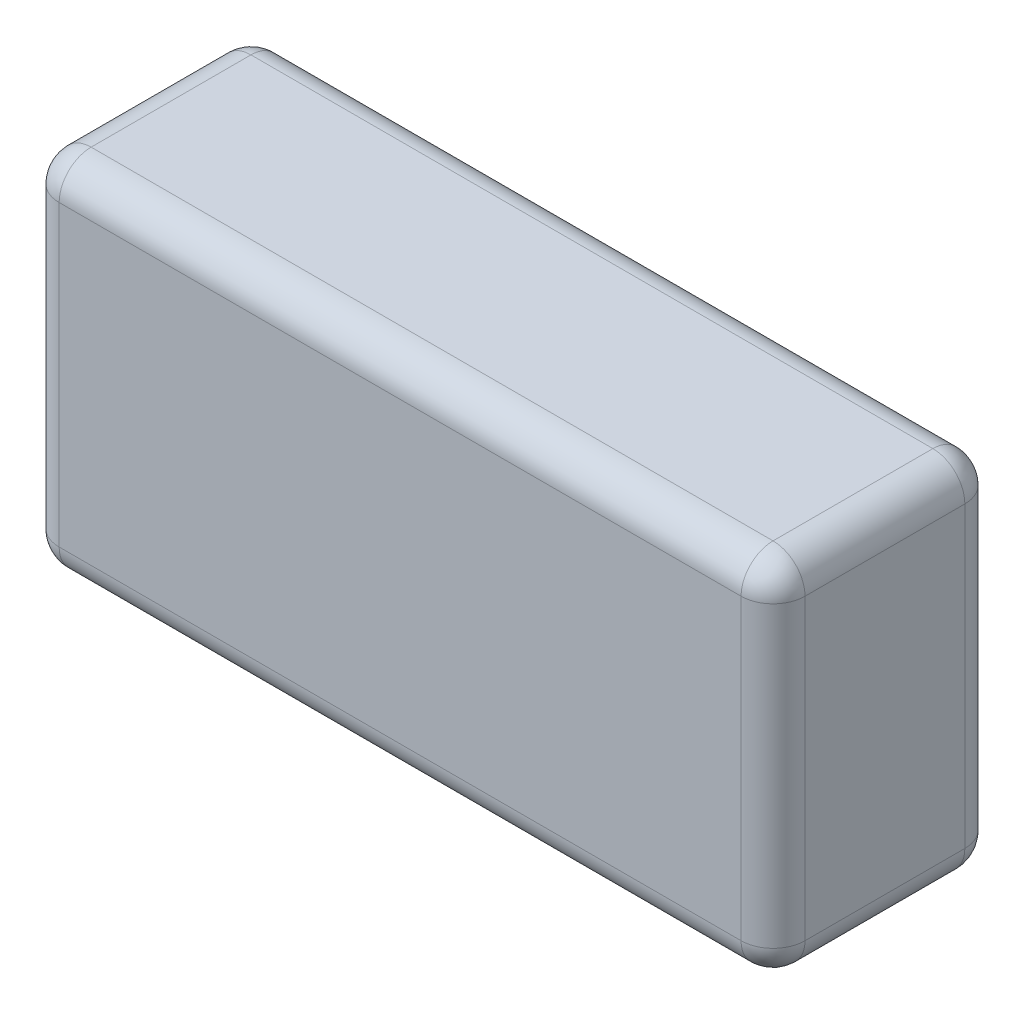
ISO-10303-21;
HEADER;
FILE_DESCRIPTION(('STEP AP214'),'2;1');
FILE_NAME('part.step','',(''),(''),'','','');
FILE_SCHEMA(('AUTOMOTIVE_DESIGN { 1 0 10303 214 1 1 1 1 }'));
ENDSEC;
DATA;
#1=APPLICATION_CONTEXT('core data for automotive mechanical design processes');
#2=APPLICATION_PROTOCOL_DEFINITION('international standard','automotive_design',2000,#1);
#3=PRODUCT_CONTEXT('',#1,'mechanical');
#4=PRODUCT('Part','Part','',(#3));
#5=PRODUCT_RELATED_PRODUCT_CATEGORY('part','',(#4));
#6=PRODUCT_DEFINITION_FORMATION('','',#4);
#7=PRODUCT_DEFINITION_CONTEXT('part definition',#1,'design');
#8=PRODUCT_DEFINITION('design','',#6,#7);
#9=PRODUCT_DEFINITION_SHAPE('','',#8);
#10=(LENGTH_UNIT() NAMED_UNIT(*) SI_UNIT(.MILLI.,.METRE.));
#11=(NAMED_UNIT(*) PLANE_ANGLE_UNIT() SI_UNIT($,.RADIAN.));
#12=(NAMED_UNIT(*) SI_UNIT($,.STERADIAN.) SOLID_ANGLE_UNIT());
#13=UNCERTAINTY_MEASURE_WITH_UNIT(LENGTH_MEASURE(1.E-05),#10,'distance_accuracy_value','');
#14=(GEOMETRIC_REPRESENTATION_CONTEXT(3) GLOBAL_UNCERTAINTY_ASSIGNED_CONTEXT((#13)) GLOBAL_UNIT_ASSIGNED_CONTEXT((#10,
#11,#12)) REPRESENTATION_CONTEXT('',''));
#15=CARTESIAN_POINT('',(0.,0.,0.));
#16=DIRECTION('',(0.,0.,1.));
#17=DIRECTION('',(1.,0.,0.));
#18=AXIS2_PLACEMENT_3D('',#15,#16,#17);
#19=CARTESIAN_POINT('',(-35.,17.,10.5));
#20=DIRECTION('',(1.,0.,0.));
#21=DIRECTION('',(0.,0.,-1.));
#22=AXIS2_PLACEMENT_3D('',#19,#20,#21);
#23=PLANE('',#22);
#24=DIRECTION('',(0.,-1.,0.));
#25=VECTOR('',#24,1.);
#26=CARTESIAN_POINT('',(-35.,17.,-7.5));
#27=LINE('',#26,#25);
#28=CARTESIAN_POINT('',(-35.,14.,-7.5));
#29=VERTEX_POINT('',#28);
#30=CARTESIAN_POINT('',(-35.,-14.,-7.5));
#31=VERTEX_POINT('',#30);
#32=EDGE_CURVE('E131',#29,#31,#27,.T.);
#33=ORIENTED_EDGE('',*,*,#32,.T.);
#34=DIRECTION('',(0.,0.,1.));
#35=VECTOR('',#34,1.);
#36=CARTESIAN_POINT('',(-35.,-14.,10.5));
#37=LINE('',#36,#35);
#38=CARTESIAN_POINT('',(-35.,-14.,7.50000000000004));
#39=VERTEX_POINT('',#38);
#40=EDGE_CURVE('E127',#31,#39,#37,.T.);
#41=ORIENTED_EDGE('',*,*,#40,.T.);
#42=DIRECTION('',(0.,-1.,0.));
#43=VECTOR('',#42,1.);
#44=CARTESIAN_POINT('',(-35.,17.,7.50000000000004));
#45=LINE('',#44,#43);
#46=CARTESIAN_POINT('',(-35.,14.,7.50000000000004));
#47=VERTEX_POINT('',#46);
#48=EDGE_CURVE('E122',#39,#47,#45,.F.);
#49=ORIENTED_EDGE('',*,*,#48,.T.);
#50=DIRECTION('',(0.,0.,1.));
#51=VECTOR('',#50,1.);
#52=CARTESIAN_POINT('',(-35.,14.,-10.5));
#53=LINE('',#52,#51);
#54=EDGE_CURVE('E124',#47,#29,#53,.F.);
#55=ORIENTED_EDGE('',*,*,#54,.T.);
#56=EDGE_LOOP('',(#33,#41,#49,#55));
#57=FACE_BOUND('',#56,.T.);
#58=ADVANCED_FACE('F34',(#57),#23,.F.);
#59=CARTESIAN_POINT('',(35.0000000000002,17.,10.5));
#60=DIRECTION('',(0.,0.,-1.));
#61=DIRECTION('',(-1.,0.,0.));
#62=AXIS2_PLACEMENT_3D('',#59,#60,#61);
#63=PLANE('',#62);
#64=DIRECTION('',(0.,-1.,0.));
#65=VECTOR('',#64,1.);
#66=CARTESIAN_POINT('',(-32.,17.,10.5));
#67=LINE('',#66,#65);
#68=CARTESIAN_POINT('',(-32.,14.,10.5));
#69=VERTEX_POINT('',#68);
#70=CARTESIAN_POINT('',(-32.,-14.,10.5));
#71=VERTEX_POINT('',#70);
#72=EDGE_CURVE('E153',#69,#71,#67,.T.);
#73=ORIENTED_EDGE('',*,*,#72,.T.);
#74=DIRECTION('',(1.,0.,0.));
#75=VECTOR('',#74,1.);
#76=CARTESIAN_POINT('',(35.0000000000002,-14.,10.5));
#77=LINE('',#76,#75);
#78=CARTESIAN_POINT('',(32.0000000000002,-14.,10.5));
#79=VERTEX_POINT('',#78);
#80=EDGE_CURVE('E231',#71,#79,#77,.T.);
#81=ORIENTED_EDGE('',*,*,#80,.T.);
#82=DIRECTION('',(0.,-1.,0.));
#83=VECTOR('',#82,1.);
#84=CARTESIAN_POINT('',(32.0000000000002,17.,10.5));
#85=LINE('',#84,#83);
#86=CARTESIAN_POINT('',(32.0000000000002,14.,10.5));
#87=VERTEX_POINT('',#86);
#88=EDGE_CURVE('E224',#79,#87,#85,.F.);
#89=ORIENTED_EDGE('',*,*,#88,.T.);
#90=DIRECTION('',(1.,0.,0.));
#91=VECTOR('',#90,1.);
#92=CARTESIAN_POINT('',(-35.,14.,10.5));
#93=LINE('',#92,#91);
#94=EDGE_CURVE('E222',#87,#69,#93,.F.);
#95=ORIENTED_EDGE('',*,*,#94,.T.);
#96=EDGE_LOOP('',(#73,#81,#89,#95));
#97=FACE_BOUND('',#96,.T.);
#98=ADVANCED_FACE('F321',(#97),#63,.F.);
#99=CARTESIAN_POINT('',(35.0000000000002,17.,10.5));
#100=DIRECTION('',(-1.,0.,0.));
#101=DIRECTION('',(0.,0.,1.));
#102=AXIS2_PLACEMENT_3D('',#99,#100,#101);
#103=PLANE('',#102);
#104=DIRECTION('',(0.,0.,-1.));
#105=VECTOR('',#104,1.);
#106=CARTESIAN_POINT('',(35.0000000000002,-14.,10.5));
#107=LINE('',#106,#105);
#108=CARTESIAN_POINT('',(35.0000000000002,-14.,7.50000000000004));
#109=VERTEX_POINT('',#108);
#110=CARTESIAN_POINT('',(35.0000000000002,-14.,-7.5));
#111=VERTEX_POINT('',#110);
#112=EDGE_CURVE('E218',#109,#111,#107,.T.);
#113=ORIENTED_EDGE('',*,*,#112,.T.);
#114=DIRECTION('',(0.,-1.,0.));
#115=VECTOR('',#114,1.);
#116=CARTESIAN_POINT('',(35.0000000000002,17.,-7.5));
#117=LINE('',#116,#115);
#118=CARTESIAN_POINT('',(35.0000000000002,14.,-7.5));
#119=VERTEX_POINT('',#118);
#120=EDGE_CURVE('E215',#111,#119,#117,.F.);
#121=ORIENTED_EDGE('',*,*,#120,.T.);
#122=DIRECTION('',(0.,0.,-1.));
#123=VECTOR('',#122,1.);
#124=CARTESIAN_POINT('',(35.0000000000002,14.,10.5));
#125=LINE('',#124,#123);
#126=CARTESIAN_POINT('',(35.0000000000002,14.,7.50000000000004));
#127=VERTEX_POINT('',#126);
#128=EDGE_CURVE('E208',#119,#127,#125,.F.);
#129=ORIENTED_EDGE('',*,*,#128,.T.);
#130=DIRECTION('',(0.,-1.,0.));
#131=VECTOR('',#130,1.);
#132=CARTESIAN_POINT('',(35.0000000000002,17.,7.50000000000004));
#133=LINE('',#132,#131);
#134=EDGE_CURVE('E211',#127,#109,#133,.T.);
#135=ORIENTED_EDGE('',*,*,#134,.T.);
#136=EDGE_LOOP('',(#113,#121,#129,#135));
#137=FACE_BOUND('',#136,.T.);
#138=ADVANCED_FACE('F216',(#137),#103,.F.);
#139=CARTESIAN_POINT('',(35.0000000000002,17.,-10.5));
#140=DIRECTION('',(0.,0.,1.));
#141=DIRECTION('',(1.,0.,0.));
#142=AXIS2_PLACEMENT_3D('',#139,#140,#141);
#143=PLANE('',#142);
#144=DIRECTION('',(-1.,0.,0.));
#145=VECTOR('',#144,1.);
#146=CARTESIAN_POINT('',(35.0000000000002,-14.,-10.5));
#147=LINE('',#146,#145);
#148=CARTESIAN_POINT('',(32.0000000000002,-14.,-10.5));
#149=VERTEX_POINT('',#148);
#150=CARTESIAN_POINT('',(-32.,-14.,-10.5));
#151=VERTEX_POINT('',#150);
#152=EDGE_CURVE('E280',#149,#151,#147,.T.);
#153=ORIENTED_EDGE('',*,*,#152,.T.);
#154=DIRECTION('',(0.,-1.,0.));
#155=VECTOR('',#154,1.);
#156=CARTESIAN_POINT('',(-32.,17.,-10.5));
#157=LINE('',#156,#155);
#158=CARTESIAN_POINT('',(-32.,14.,-10.5));
#159=VERTEX_POINT('',#158);
#160=EDGE_CURVE('E212',#151,#159,#157,.F.);
#161=ORIENTED_EDGE('',*,*,#160,.T.);
#162=DIRECTION('',(-1.,0.,0.));
#163=VECTOR('',#162,1.);
#164=CARTESIAN_POINT('',(35.0000000000002,14.,-10.5));
#165=LINE('',#164,#163);
#166=CARTESIAN_POINT('',(32.0000000000002,14.,-10.5));
#167=VERTEX_POINT('',#166);
#168=EDGE_CURVE('E273',#159,#167,#165,.F.);
#169=ORIENTED_EDGE('',*,*,#168,.T.);
#170=DIRECTION('',(0.,-1.,0.));
#171=VECTOR('',#170,1.);
#172=CARTESIAN_POINT('',(32.0000000000002,17.,-10.5));
#173=LINE('',#172,#171);
#174=EDGE_CURVE('E275',#167,#149,#173,.T.);
#175=ORIENTED_EDGE('',*,*,#174,.T.);
#176=EDGE_LOOP('',(#153,#161,#169,#175));
#177=FACE_BOUND('',#176,.T.);
#178=ADVANCED_FACE('F305',(#177),#143,.F.);
#179=CARTESIAN_POINT('',(0.,17.,0.));
#180=DIRECTION('',(0.,1.,0.));
#181=DIRECTION('',(0.,0.,1.));
#182=AXIS2_PLACEMENT_3D('',#179,#180,#181);
#183=PLANE('',#182);
#184=DIRECTION('',(0.,0.,-1.));
#185=VECTOR('',#184,1.);
#186=CARTESIAN_POINT('',(32.0000000000002,17.,-10.5));
#187=LINE('',#186,#185);
#188=CARTESIAN_POINT('',(32.0000000000002,17.,7.50000000000004));
#189=VERTEX_POINT('',#188);
#190=CARTESIAN_POINT('',(32.0000000000002,17.,-7.5));
#191=VERTEX_POINT('',#190);
#192=EDGE_CURVE('E43',#189,#191,#187,.T.);
#193=ORIENTED_EDGE('',*,*,#192,.T.);
#194=DIRECTION('',(-1.,0.,0.));
#195=VECTOR('',#194,1.);
#196=CARTESIAN_POINT('',(-35.,17.,-7.5));
#197=LINE('',#196,#195);
#198=CARTESIAN_POINT('',(-32.,17.,-7.5));
#199=VERTEX_POINT('',#198);
#200=EDGE_CURVE('E11',#191,#199,#197,.T.);
#201=ORIENTED_EDGE('',*,*,#200,.T.);
#202=DIRECTION('',(0.,0.,1.));
#203=VECTOR('',#202,1.);
#204=CARTESIAN_POINT('',(-32.,17.,10.5));
#205=LINE('',#204,#203);
#206=CARTESIAN_POINT('',(-32.,17.,7.50000000000004));
#207=VERTEX_POINT('',#206);
#208=EDGE_CURVE('E233',#199,#207,#205,.T.);
#209=ORIENTED_EDGE('',*,*,#208,.T.);
#210=DIRECTION('',(1.,0.,0.));
#211=VECTOR('',#210,1.);
#212=CARTESIAN_POINT('',(35.0000000000002,17.,7.50000000000004));
#213=LINE('',#212,#211);
#214=EDGE_CURVE('E54',#207,#189,#213,.T.);
#215=ORIENTED_EDGE('',*,*,#214,.T.);
#216=EDGE_LOOP('',(#193,#201,#209,#215));
#217=FACE_BOUND('',#216,.T.);
#218=ADVANCED_FACE('F484',(#217),#183,.T.);
#219=CARTESIAN_POINT('',(0.,-17.,0.));
#220=DIRECTION('',(0.,1.,0.));
#221=DIRECTION('',(0.,0.,1.));
#222=AXIS2_PLACEMENT_3D('',#219,#220,#221);
#223=PLANE('',#222);
#224=DIRECTION('',(1.,0.,0.));
#225=VECTOR('',#224,1.);
#226=CARTESIAN_POINT('',(0.,-17.,7.50000000000004));
#227=LINE('',#226,#225);
#228=CARTESIAN_POINT('',(32.0000000000002,-17.,7.50000000000004));
#229=VERTEX_POINT('',#228);
#230=CARTESIAN_POINT('',(-32.,-17.,7.50000000000004));
#231=VERTEX_POINT('',#230);
#232=EDGE_CURVE('E269',#229,#231,#227,.F.);
#233=ORIENTED_EDGE('',*,*,#232,.T.);
#234=DIRECTION('',(0.,0.,1.));
#235=VECTOR('',#234,1.);
#236=CARTESIAN_POINT('',(-32.,-17.,0.));
#237=LINE('',#236,#235);
#238=CARTESIAN_POINT('',(-32.,-17.,-7.5));
#239=VERTEX_POINT('',#238);
#240=EDGE_CURVE('E263',#231,#239,#237,.F.);
#241=ORIENTED_EDGE('',*,*,#240,.T.);
#242=DIRECTION('',(-1.,0.,0.));
#243=VECTOR('',#242,1.);
#244=CARTESIAN_POINT('',(0.,-17.,-7.5));
#245=LINE('',#244,#243);
#246=CARTESIAN_POINT('',(32.0000000000002,-17.,-7.5));
#247=VERTEX_POINT('',#246);
#248=EDGE_CURVE('E257',#239,#247,#245,.F.);
#249=ORIENTED_EDGE('',*,*,#248,.T.);
#250=DIRECTION('',(0.,0.,-1.));
#251=VECTOR('',#250,1.);
#252=CARTESIAN_POINT('',(32.0000000000002,-17.,0.));
#253=LINE('',#252,#251);
#254=EDGE_CURVE('E264',#247,#229,#253,.F.);
#255=ORIENTED_EDGE('',*,*,#254,.T.);
#256=EDGE_LOOP('',(#233,#241,#249,#255));
#257=FACE_BOUND('',#256,.T.);
#258=ADVANCED_FACE('F267',(#257),#223,.F.);
#259=CARTESIAN_POINT('',(32.0000000000002,14.,0.));
#260=DIRECTION('',(0.,0.,1.));
#261=DIRECTION('',(1.,0.,0.));
#262=AXIS2_PLACEMENT_3D('',#259,#260,#261);
#263=CYLINDRICAL_SURFACE('',#262,3.);
#264=CARTESIAN_POINT('',(32.0000000000002,14.,-7.5));
#265=DIRECTION('',(0.,0.,-1.));
#266=DIRECTION('',(-1.,0.,0.));
#267=AXIS2_PLACEMENT_3D('',#264,#265,#266);
#268=CIRCLE('',#267,3.);
#269=EDGE_CURVE('E38',#191,#119,#268,.T.);
#270=ORIENTED_EDGE('',*,*,#269,.F.);
#271=ORIENTED_EDGE('',*,*,#192,.F.);
#272=CARTESIAN_POINT('',(32.0000000000002,14.,7.50000000000004));
#273=DIRECTION('',(0.,0.,1.));
#274=DIRECTION('',(1.,0.,0.));
#275=AXIS2_PLACEMENT_3D('',#272,#273,#274);
#276=CIRCLE('',#275,3.);
#277=EDGE_CURVE('E193',#127,#189,#276,.T.);
#278=ORIENTED_EDGE('',*,*,#277,.F.);
#279=ORIENTED_EDGE('',*,*,#128,.F.);
#280=EDGE_LOOP('',(#270,#271,#278,#279));
#281=FACE_BOUND('',#280,.T.);
#282=ADVANCED_FACE('F36',(#281),#263,.T.);
#283=CARTESIAN_POINT('',(32.0000000000002,14.,-7.5));
#284=DIRECTION('',(0.,0.,1.));
#285=DIRECTION('',(1.,0.,0.));
#286=AXIS2_PLACEMENT_3D('',#283,#284,#285);
#287=SPHERICAL_SURFACE('',#286,3.);
#288=CARTESIAN_POINT('',(32.0000000000002,14.,-7.5));
#289=DIRECTION('',(1.,0.,0.));
#290=DIRECTION('',(0.,0.,-1.));
#291=AXIS2_PLACEMENT_3D('',#288,#289,#290);
#292=CIRCLE('',#291,3.);
#293=EDGE_CURVE('E189',#191,#167,#292,.F.);
#294=ORIENTED_EDGE('',*,*,#293,.F.);
#295=ORIENTED_EDGE('',*,*,#269,.T.);
#296=CARTESIAN_POINT('',(32.0000000000002,14.,-7.5));
#297=DIRECTION('',(0.,1.,0.));
#298=DIRECTION('',(0.,0.,1.));
#299=AXIS2_PLACEMENT_3D('',#296,#297,#298);
#300=CIRCLE('',#299,3.);
#301=EDGE_CURVE('E192',#167,#119,#300,.F.);
#302=ORIENTED_EDGE('',*,*,#301,.F.);
#303=EDGE_LOOP('',(#294,#295,#302));
#304=FACE_BOUND('',#303,.T.);
#305=ADVANCED_FACE('F204',(#304),#287,.T.);
#306=CARTESIAN_POINT('',(32.0000000000002,14.,7.50000000000004));
#307=DIRECTION('',(0.,0.,1.));
#308=DIRECTION('',(1.,0.,0.));
#309=AXIS2_PLACEMENT_3D('',#306,#307,#308);
#310=SPHERICAL_SURFACE('',#309,3.);
#311=CARTESIAN_POINT('',(32.0000000000002,14.,7.50000000000004));
#312=DIRECTION('',(0.,1.,0.));
#313=DIRECTION('',(0.,0.,1.));
#314=AXIS2_PLACEMENT_3D('',#311,#312,#313);
#315=CIRCLE('',#314,3.);
#316=EDGE_CURVE('E183',#127,#87,#315,.F.);
#317=ORIENTED_EDGE('',*,*,#316,.F.);
#318=ORIENTED_EDGE('',*,*,#277,.T.);
#319=CARTESIAN_POINT('',(32.0000000000002,14.,7.50000000000004));
#320=DIRECTION('',(1.,0.,0.));
#321=DIRECTION('',(0.,0.,-1.));
#322=AXIS2_PLACEMENT_3D('',#319,#320,#321);
#323=CIRCLE('',#322,3.);
#324=EDGE_CURVE('E186',#87,#189,#323,.F.);
#325=ORIENTED_EDGE('',*,*,#324,.F.);
#326=EDGE_LOOP('',(#317,#318,#325));
#327=FACE_BOUND('',#326,.T.);
#328=ADVANCED_FACE('F457',(#327),#310,.T.);
#329=CARTESIAN_POINT('',(32.0000000000002,17.,-7.5));
#330=DIRECTION('',(0.,-1.,0.));
#331=DIRECTION('',(0.,0.,-1.));
#332=AXIS2_PLACEMENT_3D('',#329,#330,#331);
#333=CYLINDRICAL_SURFACE('',#332,3.);
#334=ORIENTED_EDGE('',*,*,#301,.T.);
#335=ORIENTED_EDGE('',*,*,#120,.F.);
#336=CARTESIAN_POINT('',(32.0000000000002,-14.,-7.5));
#337=DIRECTION('',(0.,-1.,0.));
#338=DIRECTION('',(0.,0.,-1.));
#339=AXIS2_PLACEMENT_3D('',#336,#337,#338);
#340=CIRCLE('',#339,3.);
#341=EDGE_CURVE('E177',#149,#111,#340,.T.);
#342=ORIENTED_EDGE('',*,*,#341,.F.);
#343=ORIENTED_EDGE('',*,*,#174,.F.);
#344=EDGE_LOOP('',(#334,#335,#342,#343));
#345=FACE_BOUND('',#344,.T.);
#346=ADVANCED_FACE('F307',(#345),#333,.T.);
#347=CARTESIAN_POINT('',(0.,14.,-7.5));
#348=DIRECTION('',(1.,0.,0.));
#349=DIRECTION('',(0.,0.,-1.));
#350=AXIS2_PLACEMENT_3D('',#347,#348,#349);
#351=CYLINDRICAL_SURFACE('',#350,3.);
#352=ORIENTED_EDGE('',*,*,#293,.T.);
#353=ORIENTED_EDGE('',*,*,#168,.F.);
#354=CARTESIAN_POINT('',(-32.,14.,-7.5));
#355=DIRECTION('',(-1.,0.,0.));
#356=DIRECTION('',(0.,0.,1.));
#357=AXIS2_PLACEMENT_3D('',#354,#355,#356);
#358=CIRCLE('',#357,3.);
#359=EDGE_CURVE('E174',#199,#159,#358,.T.);
#360=ORIENTED_EDGE('',*,*,#359,.F.);
#361=ORIENTED_EDGE('',*,*,#200,.F.);
#362=EDGE_LOOP('',(#352,#353,#360,#361));
#363=FACE_BOUND('',#362,.T.);
#364=ADVANCED_FACE('F441',(#363),#351,.T.);
#365=CARTESIAN_POINT('',(-32.,14.,0.));
#366=DIRECTION('',(0.,0.,-1.));
#367=DIRECTION('',(-1.,0.,0.));
#368=AXIS2_PLACEMENT_3D('',#365,#366,#367);
#369=CYLINDRICAL_SURFACE('',#368,3.);
#370=CARTESIAN_POINT('',(-32.,14.,7.50000000000004));
#371=DIRECTION('',(0.,0.,1.));
#372=DIRECTION('',(1.,0.,0.));
#373=AXIS2_PLACEMENT_3D('',#370,#371,#372);
#374=CIRCLE('',#373,3.);
#375=EDGE_CURVE('E138',#207,#47,#374,.T.);
#376=ORIENTED_EDGE('',*,*,#375,.F.);
#377=ORIENTED_EDGE('',*,*,#208,.F.);
#378=CARTESIAN_POINT('',(-32.,14.,-7.5));
#379=DIRECTION('',(0.,0.,-1.));
#380=DIRECTION('',(0.,1.,0.));
#381=AXIS2_PLACEMENT_3D('',#378,#379,#380);
#382=CIRCLE('',#381,3.);
#383=EDGE_CURVE('E140',#29,#199,#382,.T.);
#384=ORIENTED_EDGE('',*,*,#383,.F.);
#385=ORIENTED_EDGE('',*,*,#54,.F.);
#386=EDGE_LOOP('',(#376,#377,#384,#385));
#387=FACE_BOUND('',#386,.T.);
#388=ADVANCED_FACE('F136',(#387),#369,.T.);
#389=CARTESIAN_POINT('',(0.,14.,7.50000000000004));
#390=DIRECTION('',(-1.,0.,0.));
#391=DIRECTION('',(0.,0.,1.));
#392=AXIS2_PLACEMENT_3D('',#389,#390,#391);
#393=CYLINDRICAL_SURFACE('',#392,3.);
#394=ORIENTED_EDGE('',*,*,#324,.T.);
#395=ORIENTED_EDGE('',*,*,#214,.F.);
#396=CARTESIAN_POINT('',(-32.,14.,7.50000000000004));
#397=DIRECTION('',(-1.,0.,0.));
#398=DIRECTION('',(0.,-1.,0.));
#399=AXIS2_PLACEMENT_3D('',#396,#397,#398);
#400=CIRCLE('',#399,3.);
#401=EDGE_CURVE('E149',#69,#207,#400,.T.);
#402=ORIENTED_EDGE('',*,*,#401,.F.);
#403=ORIENTED_EDGE('',*,*,#94,.F.);
#404=EDGE_LOOP('',(#394,#395,#402,#403));
#405=FACE_BOUND('',#404,.T.);
#406=ADVANCED_FACE('F425',(#405),#393,.T.);
#407=CARTESIAN_POINT('',(32.0000000000002,17.,7.50000000000004));
#408=DIRECTION('',(0.,-1.,0.));
#409=DIRECTION('',(0.,0.,-1.));
#410=AXIS2_PLACEMENT_3D('',#407,#408,#409);
#411=CYLINDRICAL_SURFACE('',#410,3.);
#412=ORIENTED_EDGE('',*,*,#316,.T.);
#413=ORIENTED_EDGE('',*,*,#88,.F.);
#414=CARTESIAN_POINT('',(32.0000000000002,-14.,7.50000000000004));
#415=DIRECTION('',(0.,-1.,0.));
#416=DIRECTION('',(0.,0.,-1.));
#417=AXIS2_PLACEMENT_3D('',#414,#415,#416);
#418=CIRCLE('',#417,3.);
#419=EDGE_CURVE('E169',#109,#79,#418,.T.);
#420=ORIENTED_EDGE('',*,*,#419,.F.);
#421=ORIENTED_EDGE('',*,*,#134,.F.);
#422=EDGE_LOOP('',(#412,#413,#420,#421));
#423=FACE_BOUND('',#422,.T.);
#424=ADVANCED_FACE('F291',(#423),#411,.T.);
#425=CARTESIAN_POINT('',(32.0000000000002,-14.,10.5));
#426=DIRECTION('',(0.,0.,-1.));
#427=DIRECTION('',(-1.,0.,0.));
#428=AXIS2_PLACEMENT_3D('',#425,#426,#427);
#429=CYLINDRICAL_SURFACE('',#428,3.);
#430=CARTESIAN_POINT('',(32.0000000000002,-14.,-7.5));
#431=DIRECTION('',(0.,0.,-1.));
#432=DIRECTION('',(-1.,0.,0.));
#433=AXIS2_PLACEMENT_3D('',#430,#431,#432);
#434=CIRCLE('',#433,3.);
#435=EDGE_CURVE('E180',#111,#247,#434,.T.);
#436=ORIENTED_EDGE('',*,*,#435,.F.);
#437=ORIENTED_EDGE('',*,*,#112,.F.);
#438=CARTESIAN_POINT('',(32.0000000000002,-14.,7.50000000000004));
#439=DIRECTION('',(0.,0.,1.));
#440=DIRECTION('',(1.,0.,0.));
#441=AXIS2_PLACEMENT_3D('',#438,#439,#440);
#442=CIRCLE('',#441,3.);
#443=EDGE_CURVE('E166',#229,#109,#442,.T.);
#444=ORIENTED_EDGE('',*,*,#443,.F.);
#445=ORIENTED_EDGE('',*,*,#254,.F.);
#446=EDGE_LOOP('',(#436,#437,#444,#445));
#447=FACE_BOUND('',#446,.T.);
#448=ADVANCED_FACE('F288',(#447),#429,.T.);
#449=CARTESIAN_POINT('',(32.0000000000002,-14.,-7.5));
#450=DIRECTION('',(0.,0.,1.));
#451=DIRECTION('',(1.,0.,0.));
#452=AXIS2_PLACEMENT_3D('',#449,#450,#451);
#453=SPHERICAL_SURFACE('',#452,3.);
#454=ORIENTED_EDGE('',*,*,#341,.T.);
#455=ORIENTED_EDGE('',*,*,#435,.T.);
#456=CARTESIAN_POINT('',(32.0000000000002,-14.,-7.5));
#457=DIRECTION('',(1.,0.,0.));
#458=DIRECTION('',(0.,0.,-1.));
#459=AXIS2_PLACEMENT_3D('',#456,#457,#458);
#460=CIRCLE('',#459,3.);
#461=EDGE_CURVE('E157',#149,#247,#460,.F.);
#462=ORIENTED_EDGE('',*,*,#461,.F.);
#463=EDGE_LOOP('',(#454,#455,#462));
#464=FACE_BOUND('',#463,.T.);
#465=ADVANCED_FACE('F309',(#464),#453,.T.);
#466=CARTESIAN_POINT('',(-32.,14.,-7.5));
#467=DIRECTION('',(0.,0.,1.));
#468=DIRECTION('',(1.,0.,0.));
#469=AXIS2_PLACEMENT_3D('',#466,#467,#468);
#470=SPHERICAL_SURFACE('',#469,3.);
#471=ORIENTED_EDGE('',*,*,#383,.T.);
#472=ORIENTED_EDGE('',*,*,#359,.T.);
#473=CARTESIAN_POINT('',(-32.,14.,-7.5));
#474=DIRECTION('',(0.,1.,0.));
#475=DIRECTION('',(0.,0.,1.));
#476=AXIS2_PLACEMENT_3D('',#473,#474,#475);
#477=CIRCLE('',#476,3.);
#478=EDGE_CURVE('E154',#29,#159,#477,.F.);
#479=ORIENTED_EDGE('',*,*,#478,.F.);
#480=EDGE_LOOP('',(#471,#472,#479));
#481=FACE_BOUND('',#480,.T.);
#482=ADVANCED_FACE('F311',(#481),#470,.T.);
#483=CARTESIAN_POINT('',(-32.,14.,7.50000000000004));
#484=DIRECTION('',(0.,0.,1.));
#485=DIRECTION('',(1.,0.,0.));
#486=AXIS2_PLACEMENT_3D('',#483,#484,#485);
#487=SPHERICAL_SURFACE('',#486,3.);
#488=ORIENTED_EDGE('',*,*,#401,.T.);
#489=ORIENTED_EDGE('',*,*,#375,.T.);
#490=CARTESIAN_POINT('',(-32.,14.,7.50000000000004));
#491=DIRECTION('',(0.,1.,0.));
#492=DIRECTION('',(0.,0.,1.));
#493=AXIS2_PLACEMENT_3D('',#490,#491,#492);
#494=CIRCLE('',#493,3.);
#495=EDGE_CURVE('E146',#69,#47,#494,.F.);
#496=ORIENTED_EDGE('',*,*,#495,.F.);
#497=EDGE_LOOP('',(#488,#489,#496));
#498=FACE_BOUND('',#497,.T.);
#499=ADVANCED_FACE('F145',(#498),#487,.T.);
#500=CARTESIAN_POINT('',(32.0000000000002,-14.,7.50000000000004));
#501=DIRECTION('',(0.,0.,1.));
#502=DIRECTION('',(1.,0.,0.));
#503=AXIS2_PLACEMENT_3D('',#500,#501,#502);
#504=SPHERICAL_SURFACE('',#503,3.);
#505=ORIENTED_EDGE('',*,*,#443,.T.);
#506=ORIENTED_EDGE('',*,*,#419,.T.);
#507=CARTESIAN_POINT('',(32.0000000000002,-14.,7.50000000000004));
#508=DIRECTION('',(1.,0.,0.));
#509=DIRECTION('',(0.,0.,-1.));
#510=AXIS2_PLACEMENT_3D('',#507,#508,#509);
#511=CIRCLE('',#510,3.);
#512=EDGE_CURVE('E155',#229,#79,#511,.F.);
#513=ORIENTED_EDGE('',*,*,#512,.F.);
#514=EDGE_LOOP('',(#505,#506,#513));
#515=FACE_BOUND('',#514,.T.);
#516=ADVANCED_FACE('F293',(#515),#504,.T.);
#517=CARTESIAN_POINT('',(35.0000000000002,-14.,-7.5));
#518=DIRECTION('',(-1.,0.,0.));
#519=DIRECTION('',(0.,0.,1.));
#520=AXIS2_PLACEMENT_3D('',#517,#518,#519);
#521=CYLINDRICAL_SURFACE('',#520,3.);
#522=ORIENTED_EDGE('',*,*,#461,.T.);
#523=ORIENTED_EDGE('',*,*,#248,.F.);
#524=CARTESIAN_POINT('',(-32.,-14.,-7.5));
#525=DIRECTION('',(-1.,0.,0.));
#526=DIRECTION('',(0.,0.,1.));
#527=AXIS2_PLACEMENT_3D('',#524,#525,#526);
#528=CIRCLE('',#527,3.);
#529=EDGE_CURVE('E160',#151,#239,#528,.T.);
#530=ORIENTED_EDGE('',*,*,#529,.F.);
#531=ORIENTED_EDGE('',*,*,#152,.F.);
#532=EDGE_LOOP('',(#522,#523,#530,#531));
#533=FACE_BOUND('',#532,.T.);
#534=ADVANCED_FACE('F259',(#533),#521,.T.);
#535=CARTESIAN_POINT('',(-32.,17.,-7.5));
#536=DIRECTION('',(0.,-1.,0.));
#537=DIRECTION('',(0.,0.,-1.));
#538=AXIS2_PLACEMENT_3D('',#535,#536,#537);
#539=CYLINDRICAL_SURFACE('',#538,3.);
#540=ORIENTED_EDGE('',*,*,#478,.T.);
#541=ORIENTED_EDGE('',*,*,#160,.F.);
#542=CARTESIAN_POINT('',(-32.,-14.,-7.5));
#543=DIRECTION('',(0.,-1.,0.));
#544=DIRECTION('',(0.,0.,-1.));
#545=AXIS2_PLACEMENT_3D('',#542,#543,#544);
#546=CIRCLE('',#545,3.);
#547=EDGE_CURVE('E246',#31,#151,#546,.T.);
#548=ORIENTED_EDGE('',*,*,#547,.F.);
#549=ORIENTED_EDGE('',*,*,#32,.F.);
#550=EDGE_LOOP('',(#540,#541,#548,#549));
#551=FACE_BOUND('',#550,.T.);
#552=ADVANCED_FACE('F303',(#551),#539,.T.);
#553=CARTESIAN_POINT('',(-32.,17.,7.50000000000004));
#554=DIRECTION('',(0.,-1.,0.));
#555=DIRECTION('',(0.,0.,-1.));
#556=AXIS2_PLACEMENT_3D('',#553,#554,#555);
#557=CYLINDRICAL_SURFACE('',#556,3.);
#558=ORIENTED_EDGE('',*,*,#495,.T.);
#559=ORIENTED_EDGE('',*,*,#48,.F.);
#560=CARTESIAN_POINT('',(-32.,-14.,7.50000000000004));
#561=DIRECTION('',(0.,-1.,0.));
#562=DIRECTION('',(0.,0.,-1.));
#563=AXIS2_PLACEMENT_3D('',#560,#561,#562);
#564=CIRCLE('',#563,3.);
#565=EDGE_CURVE('E243',#71,#39,#564,.T.);
#566=ORIENTED_EDGE('',*,*,#565,.F.);
#567=ORIENTED_EDGE('',*,*,#72,.F.);
#568=EDGE_LOOP('',(#558,#559,#566,#567));
#569=FACE_BOUND('',#568,.T.);
#570=ADVANCED_FACE('F151',(#569),#557,.T.);
#571=CARTESIAN_POINT('',(35.0000000000002,-14.,7.50000000000004));
#572=DIRECTION('',(1.,0.,0.));
#573=DIRECTION('',(0.,0.,-1.));
#574=AXIS2_PLACEMENT_3D('',#571,#572,#573);
#575=CYLINDRICAL_SURFACE('',#574,3.);
#576=ORIENTED_EDGE('',*,*,#512,.T.);
#577=ORIENTED_EDGE('',*,*,#80,.F.);
#578=CARTESIAN_POINT('',(-32.,-14.,7.50000000000004));
#579=DIRECTION('',(-1.,0.,0.));
#580=DIRECTION('',(0.,0.,1.));
#581=AXIS2_PLACEMENT_3D('',#578,#579,#580);
#582=CIRCLE('',#581,3.);
#583=EDGE_CURVE('E241',#231,#71,#582,.T.);
#584=ORIENTED_EDGE('',*,*,#583,.F.);
#585=ORIENTED_EDGE('',*,*,#232,.F.);
#586=EDGE_LOOP('',(#576,#577,#584,#585));
#587=FACE_BOUND('',#586,.T.);
#588=ADVANCED_FACE('F296',(#587),#575,.T.);
#589=CARTESIAN_POINT('',(-32.,-14.,-7.5));
#590=DIRECTION('',(0.,0.,1.));
#591=DIRECTION('',(1.,0.,0.));
#592=AXIS2_PLACEMENT_3D('',#589,#590,#591);
#593=SPHERICAL_SURFACE('',#592,3.);
#594=ORIENTED_EDGE('',*,*,#547,.T.);
#595=ORIENTED_EDGE('',*,*,#529,.T.);
#596=CARTESIAN_POINT('',(-32.,-14.,-7.5));
#597=DIRECTION('',(0.,0.,-1.));
#598=DIRECTION('',(-1.,0.,0.));
#599=AXIS2_PLACEMENT_3D('',#596,#597,#598);
#600=CIRCLE('',#599,3.);
#601=EDGE_CURVE('E239',#31,#239,#600,.F.);
#602=ORIENTED_EDGE('',*,*,#601,.F.);
#603=EDGE_LOOP('',(#594,#595,#602));
#604=FACE_BOUND('',#603,.T.);
#605=ADVANCED_FACE('F253',(#604),#593,.T.);
#606=CARTESIAN_POINT('',(-32.,-14.,7.50000000000004));
#607=DIRECTION('',(0.,0.,1.));
#608=DIRECTION('',(1.,0.,0.));
#609=AXIS2_PLACEMENT_3D('',#606,#607,#608);
#610=SPHERICAL_SURFACE('',#609,3.);
#611=ORIENTED_EDGE('',*,*,#583,.T.);
#612=ORIENTED_EDGE('',*,*,#565,.T.);
#613=CARTESIAN_POINT('',(-32.,-14.,7.50000000000004));
#614=DIRECTION('',(0.,0.,1.));
#615=DIRECTION('',(1.,0.,0.));
#616=AXIS2_PLACEMENT_3D('',#613,#614,#615);
#617=CIRCLE('',#616,3.);
#618=EDGE_CURVE('E237',#231,#39,#617,.F.);
#619=ORIENTED_EDGE('',*,*,#618,.F.);
#620=EDGE_LOOP('',(#611,#612,#619));
#621=FACE_BOUND('',#620,.T.);
#622=ADVANCED_FACE('F333',(#621),#610,.T.);
#623=CARTESIAN_POINT('',(-32.,-14.,10.5));
#624=DIRECTION('',(0.,0.,1.));
#625=DIRECTION('',(1.,0.,0.));
#626=AXIS2_PLACEMENT_3D('',#623,#624,#625);
#627=CYLINDRICAL_SURFACE('',#626,3.);
#628=ORIENTED_EDGE('',*,*,#601,.T.);
#629=ORIENTED_EDGE('',*,*,#240,.F.);
#630=ORIENTED_EDGE('',*,*,#618,.T.);
#631=ORIENTED_EDGE('',*,*,#40,.F.);
#632=EDGE_LOOP('',(#628,#629,#630,#631));
#633=FACE_BOUND('',#632,.T.);
#634=ADVANCED_FACE('F330',(#633),#627,.T.);
#635=CLOSED_SHELL('',(#58,#98,#138,#178,#218,#258,#282,#305,#328,#346,#364,#388,#406,#424,#448,
#465,#482,#499,#516,#534,#552,#570,#588,#605,#622,#634));
#636=MANIFOLD_SOLID_BREP('B2',#635);
#637=ADVANCED_BREP_SHAPE_REPRESENTATION('',(#18,#636),#14);
#638=SHAPE_DEFINITION_REPRESENTATION(#9,#637);
ENDSEC;
END-ISO-10303-21;
